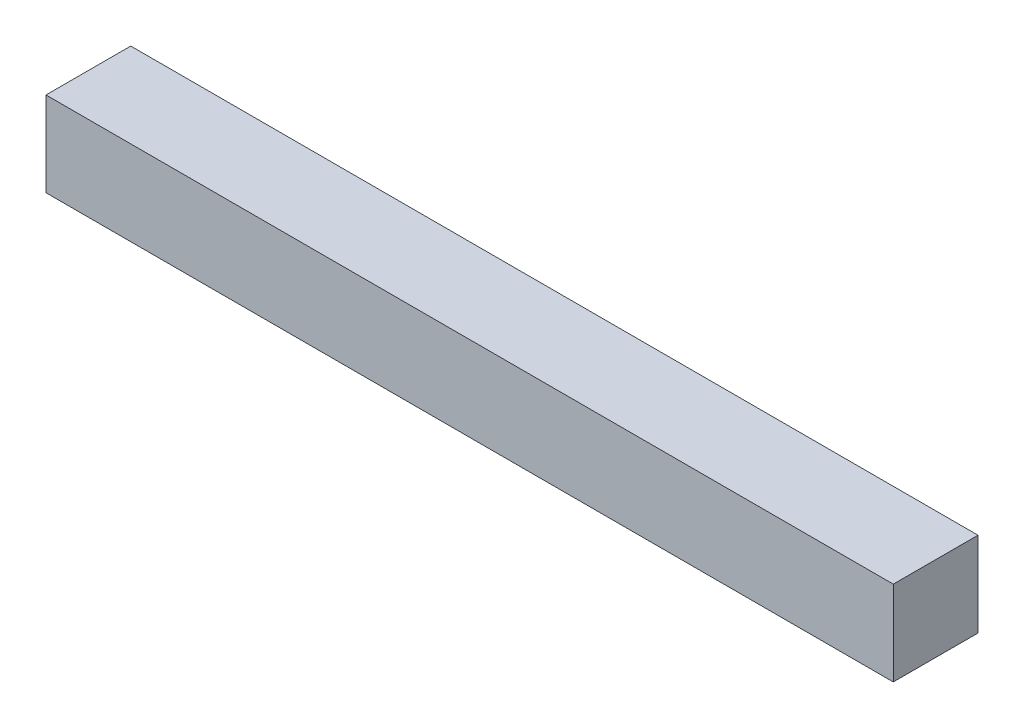
ISO-10303-21;
HEADER;
FILE_DESCRIPTION(('STEP AP214'),'2;1');
FILE_NAME('part.step','',(''),(''),'','','');
FILE_SCHEMA(('AUTOMOTIVE_DESIGN { 1 0 10303 214 1 1 1 1 }'));
ENDSEC;
DATA;
#1=APPLICATION_CONTEXT('core data for automotive mechanical design processes');
#2=APPLICATION_PROTOCOL_DEFINITION('international standard','automotive_design',2000,#1);
#3=PRODUCT_CONTEXT('',#1,'mechanical');
#4=PRODUCT('Part','Part','',(#3));
#5=PRODUCT_RELATED_PRODUCT_CATEGORY('part','',(#4));
#6=PRODUCT_DEFINITION_FORMATION('','',#4);
#7=PRODUCT_DEFINITION_CONTEXT('part definition',#1,'design');
#8=PRODUCT_DEFINITION('design','',#6,#7);
#9=PRODUCT_DEFINITION_SHAPE('','',#8);
#10=(LENGTH_UNIT() NAMED_UNIT(*) SI_UNIT(.MILLI.,.METRE.));
#11=(NAMED_UNIT(*) PLANE_ANGLE_UNIT() SI_UNIT($,.RADIAN.));
#12=(NAMED_UNIT(*) SI_UNIT($,.STERADIAN.) SOLID_ANGLE_UNIT());
#13=UNCERTAINTY_MEASURE_WITH_UNIT(LENGTH_MEASURE(1.E-05),#10,'distance_accuracy_value','');
#14=(GEOMETRIC_REPRESENTATION_CONTEXT(3) GLOBAL_UNCERTAINTY_ASSIGNED_CONTEXT((#13)) GLOBAL_UNIT_ASSIGNED_CONTEXT((#10,
#11,#12)) REPRESENTATION_CONTEXT('',''));
#15=CARTESIAN_POINT('',(0.,0.,0.));
#16=DIRECTION('',(0.,0.,1.));
#17=DIRECTION('',(1.,0.,0.));
#18=AXIS2_PLACEMENT_3D('',#15,#16,#17);
#19=CARTESIAN_POINT('',(75.,15.,7.5));
#20=DIRECTION('',(-1.,0.,0.));
#21=DIRECTION('',(0.,0.,1.));
#22=AXIS2_PLACEMENT_3D('',#19,#20,#21);
#23=PLANE('',#22);
#24=DIRECTION('',(0.,0.,-1.));
#25=VECTOR('',#24,1.);
#26=CARTESIAN_POINT('',(75.,0.,7.5));
#27=LINE('',#26,#25);
#28=CARTESIAN_POINT('',(75.,0.,7.5));
#29=VERTEX_POINT('',#28);
#30=CARTESIAN_POINT('',(75.,0.,-7.5));
#31=VERTEX_POINT('',#30);
#32=EDGE_CURVE('E109',#29,#31,#27,.T.);
#33=ORIENTED_EDGE('',*,*,#32,.T.);
#34=DIRECTION('',(0.,-1.,0.));
#35=VECTOR('',#34,1.);
#36=CARTESIAN_POINT('',(75.,15.,-7.5));
#37=LINE('',#36,#35);
#38=CARTESIAN_POINT('',(75.,15.,-7.5));
#39=VERTEX_POINT('',#38);
#40=EDGE_CURVE('E12',#39,#31,#37,.T.);
#41=ORIENTED_EDGE('',*,*,#40,.F.);
#42=DIRECTION('',(0.,0.,-1.));
#43=VECTOR('',#42,1.);
#44=CARTESIAN_POINT('',(75.,15.,7.5));
#45=LINE('',#44,#43);
#46=CARTESIAN_POINT('',(75.,15.,7.5));
#47=VERTEX_POINT('',#46);
#48=EDGE_CURVE('E93',#47,#39,#45,.T.);
#49=ORIENTED_EDGE('',*,*,#48,.F.);
#50=DIRECTION('',(0.,-1.,0.));
#51=VECTOR('',#50,1.);
#52=CARTESIAN_POINT('',(75.,15.,7.5));
#53=LINE('',#52,#51);
#54=EDGE_CURVE('E105',#47,#29,#53,.T.);
#55=ORIENTED_EDGE('',*,*,#54,.T.);
#56=EDGE_LOOP('',(#33,#41,#49,#55));
#57=FACE_BOUND('',#56,.T.);
#58=ADVANCED_FACE('F41',(#57),#23,.F.);
#59=CARTESIAN_POINT('',(-75.,15.,-7.5));
#60=DIRECTION('',(0.,0.,1.));
#61=DIRECTION('',(1.,0.,0.));
#62=AXIS2_PLACEMENT_3D('',#59,#60,#61);
#63=PLANE('',#62);
#64=DIRECTION('',(-1.,0.,0.));
#65=VECTOR('',#64,1.);
#66=CARTESIAN_POINT('',(-75.,0.,-7.5));
#67=LINE('',#66,#65);
#68=CARTESIAN_POINT('',(-75.,0.,-7.5));
#69=VERTEX_POINT('',#68);
#70=EDGE_CURVE('E98',#31,#69,#67,.T.);
#71=ORIENTED_EDGE('',*,*,#70,.T.);
#72=DIRECTION('',(0.,-1.,0.));
#73=VECTOR('',#72,1.);
#74=CARTESIAN_POINT('',(-75.,15.,-7.5));
#75=LINE('',#74,#73);
#76=CARTESIAN_POINT('',(-75.,15.,-7.5));
#77=VERTEX_POINT('',#76);
#78=EDGE_CURVE('E50',#77,#69,#75,.T.);
#79=ORIENTED_EDGE('',*,*,#78,.F.);
#80=DIRECTION('',(-1.,0.,0.));
#81=VECTOR('',#80,1.);
#82=CARTESIAN_POINT('',(-75.,15.,-7.5));
#83=LINE('',#82,#81);
#84=EDGE_CURVE('E88',#39,#77,#83,.T.);
#85=ORIENTED_EDGE('',*,*,#84,.F.);
#86=ORIENTED_EDGE('',*,*,#40,.T.);
#87=EDGE_LOOP('',(#71,#79,#85,#86));
#88=FACE_BOUND('',#87,.T.);
#89=ADVANCED_FACE('F97',(#88),#63,.F.);
#90=CARTESIAN_POINT('',(-75.,15.,7.5));
#91=DIRECTION('',(1.,0.,0.));
#92=DIRECTION('',(0.,0.,-1.));
#93=AXIS2_PLACEMENT_3D('',#90,#91,#92);
#94=PLANE('',#93);
#95=CARTESIAN_POINT('',(-75.,7.5,0.));
#96=DIRECTION('',(-1.,0.,0.));
#97=DIRECTION('',(0.,0.,1.));
#98=AXIS2_PLACEMENT_3D('',#95,#96,#97);
#99=CIRCLE('',#98,4.8125);
#100=CARTESIAN_POINT('',(-75.,7.5,4.81249999999999));
#101=VERTEX_POINT('',#100);
#102=EDGE_CURVE('E133',#101,#101,#99,.T.);
#103=ORIENTED_EDGE('',*,*,#102,.F.);
#104=EDGE_LOOP('',(#103));
#105=FACE_BOUND('',#104,.T.);
#106=DIRECTION('',(0.,0.,1.));
#107=VECTOR('',#106,1.);
#108=CARTESIAN_POINT('',(-75.,0.,7.5));
#109=LINE('',#108,#107);
#110=CARTESIAN_POINT('',(-75.,0.,7.5));
#111=VERTEX_POINT('',#110);
#112=EDGE_CURVE('E75',#69,#111,#109,.T.);
#113=ORIENTED_EDGE('',*,*,#112,.T.);
#114=DIRECTION('',(0.,-1.,0.));
#115=VECTOR('',#114,1.);
#116=CARTESIAN_POINT('',(-75.,15.,7.5));
#117=LINE('',#116,#115);
#118=CARTESIAN_POINT('',(-75.,15.,7.5));
#119=VERTEX_POINT('',#118);
#120=EDGE_CURVE('E100',#119,#111,#117,.T.);
#121=ORIENTED_EDGE('',*,*,#120,.F.);
#122=DIRECTION('',(0.,0.,1.));
#123=VECTOR('',#122,1.);
#124=CARTESIAN_POINT('',(-75.,15.,7.5));
#125=LINE('',#124,#123);
#126=EDGE_CURVE('E91',#77,#119,#125,.T.);
#127=ORIENTED_EDGE('',*,*,#126,.F.);
#128=ORIENTED_EDGE('',*,*,#78,.T.);
#129=EDGE_LOOP('',(#113,#121,#127,#128));
#130=FACE_BOUND('',#129,.T.);
#131=ADVANCED_FACE('F101',(#105,#130),#94,.F.);
#132=CARTESIAN_POINT('',(-75.,15.,7.5));
#133=DIRECTION('',(0.,0.,-1.));
#134=DIRECTION('',(-1.,0.,0.));
#135=AXIS2_PLACEMENT_3D('',#132,#133,#134);
#136=PLANE('',#135);
#137=DIRECTION('',(1.,0.,0.));
#138=VECTOR('',#137,1.);
#139=CARTESIAN_POINT('',(-75.,0.,7.5));
#140=LINE('',#139,#138);
#141=EDGE_CURVE('E81',#111,#29,#140,.T.);
#142=ORIENTED_EDGE('',*,*,#141,.T.);
#143=ORIENTED_EDGE('',*,*,#54,.F.);
#144=DIRECTION('',(1.,0.,0.));
#145=VECTOR('',#144,1.);
#146=CARTESIAN_POINT('',(-75.,15.,7.5));
#147=LINE('',#146,#145);
#148=EDGE_CURVE('E58',#119,#47,#147,.T.);
#149=ORIENTED_EDGE('',*,*,#148,.F.);
#150=ORIENTED_EDGE('',*,*,#120,.T.);
#151=EDGE_LOOP('',(#142,#143,#149,#150));
#152=FACE_BOUND('',#151,.T.);
#153=ADVANCED_FACE('F123',(#152),#136,.F.);
#154=CARTESIAN_POINT('',(0.,15.,0.));
#155=DIRECTION('',(0.,-1.,0.));
#156=DIRECTION('',(0.,0.,-1.));
#157=AXIS2_PLACEMENT_3D('',#154,#155,#156);
#158=PLANE('',#157);
#159=ORIENTED_EDGE('',*,*,#48,.T.);
#160=ORIENTED_EDGE('',*,*,#84,.T.);
#161=ORIENTED_EDGE('',*,*,#126,.T.);
#162=ORIENTED_EDGE('',*,*,#148,.T.);
#163=EDGE_LOOP('',(#159,#160,#161,#162));
#164=FACE_BOUND('',#163,.T.);
#165=ADVANCED_FACE('F89',(#164),#158,.F.);
#166=CARTESIAN_POINT('',(0.,0.,0.));
#167=DIRECTION('',(0.,-1.,0.));
#168=DIRECTION('',(0.,0.,-1.));
#169=AXIS2_PLACEMENT_3D('',#166,#167,#168);
#170=PLANE('',#169);
#171=ORIENTED_EDGE('',*,*,#32,.F.);
#172=ORIENTED_EDGE('',*,*,#141,.F.);
#173=ORIENTED_EDGE('',*,*,#112,.F.);
#174=ORIENTED_EDGE('',*,*,#70,.F.);
#175=EDGE_LOOP('',(#171,#172,#173,#174));
#176=FACE_BOUND('',#175,.T.);
#177=ADVANCED_FACE('F126',(#176),#170,.T.);
#178=CARTESIAN_POINT('',(88.6118055378411,7.5,0.));
#179=DIRECTION('',(-1.,0.,0.));
#180=DIRECTION('',(0.,0.,1.));
#181=AXIS2_PLACEMENT_3D('',#178,#179,#180);
#182=CYLINDRICAL_SURFACE('',#181,4.8125);
#183=CARTESIAN_POINT('',(65.,7.5,0.));
#184=DIRECTION('',(-1.,0.,0.));
#185=DIRECTION('',(0.,0.,1.));
#186=AXIS2_PLACEMENT_3D('',#183,#184,#185);
#187=CIRCLE('',#186,4.8125);
#188=CARTESIAN_POINT('',(65.,7.5,4.81249999999999));
#189=VERTEX_POINT('',#188);
#190=EDGE_CURVE('E113',#189,#189,#187,.F.);
#191=ORIENTED_EDGE('',*,*,#190,.T.);
#192=EDGE_LOOP('',(#191));
#193=FACE_BOUND('',#192,.T.);
#194=ORIENTED_EDGE('',*,*,#102,.T.);
#195=EDGE_LOOP('',(#194));
#196=FACE_BOUND('',#195,.T.);
#197=ADVANCED_FACE('F138',(#193,#196),#182,.F.);
#198=CARTESIAN_POINT('',(65.,15.,7.5));
#199=DIRECTION('',(-1.,0.,0.));
#200=DIRECTION('',(0.,0.,1.));
#201=AXIS2_PLACEMENT_3D('',#198,#199,#200);
#202=PLANE('',#201);
#203=ORIENTED_EDGE('',*,*,#190,.F.);
#204=EDGE_LOOP('',(#203));
#205=FACE_BOUND('',#204,.T.);
#206=ADVANCED_FACE('F189',(#205),#202,.T.);
#207=CLOSED_SHELL('',(#58,#89,#131,#153,#165,#177,#197,#206));
#208=MANIFOLD_SOLID_BREP('B2',#207);
#209=ADVANCED_BREP_SHAPE_REPRESENTATION('',(#18,#208),#14);
#210=SHAPE_DEFINITION_REPRESENTATION(#9,#209);
ENDSEC;
END-ISO-10303-21;
